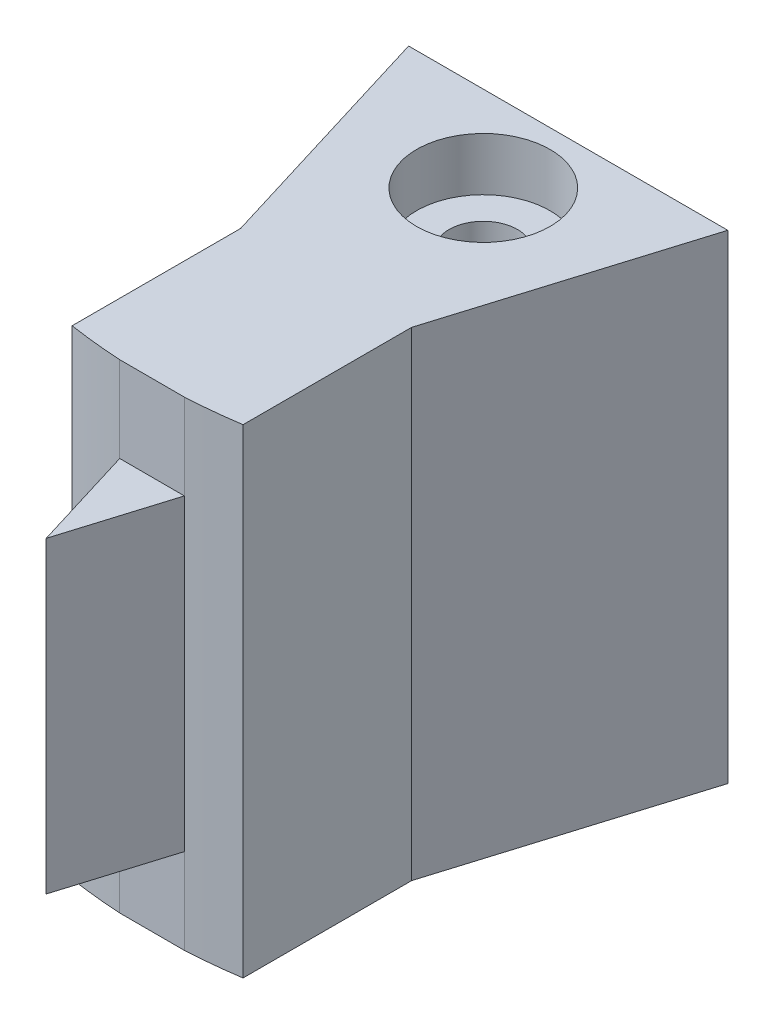
ISO-10303-21;
HEADER;
FILE_DESCRIPTION(('STEP AP214'),'2;1');
FILE_NAME('part.step','',(''),(''),'','','');
FILE_SCHEMA(('AUTOMOTIVE_DESIGN { 1 0 10303 214 1 1 1 1 }'));
ENDSEC;
DATA;
#1=APPLICATION_CONTEXT('core data for automotive mechanical design processes');
#2=APPLICATION_PROTOCOL_DEFINITION('international standard','automotive_design',2000,#1);
#3=PRODUCT_CONTEXT('',#1,'mechanical');
#4=PRODUCT('Part','Part','',(#3));
#5=PRODUCT_RELATED_PRODUCT_CATEGORY('part','',(#4));
#6=PRODUCT_DEFINITION_FORMATION('','',#4);
#7=PRODUCT_DEFINITION_CONTEXT('part definition',#1,'design');
#8=PRODUCT_DEFINITION('design','',#6,#7);
#9=PRODUCT_DEFINITION_SHAPE('','',#8);
#10=(LENGTH_UNIT() NAMED_UNIT(*) SI_UNIT(.MILLI.,.METRE.));
#11=(NAMED_UNIT(*) PLANE_ANGLE_UNIT() SI_UNIT($,.RADIAN.));
#12=(NAMED_UNIT(*) SI_UNIT($,.STERADIAN.) SOLID_ANGLE_UNIT());
#13=UNCERTAINTY_MEASURE_WITH_UNIT(LENGTH_MEASURE(1.E-05),#10,'distance_accuracy_value','');
#14=(GEOMETRIC_REPRESENTATION_CONTEXT(3) GLOBAL_UNCERTAINTY_ASSIGNED_CONTEXT((#13)) GLOBAL_UNIT_ASSIGNED_CONTEXT((#10,
#11,#12)) REPRESENTATION_CONTEXT('',''));
#15=CARTESIAN_POINT('',(0.,0.,0.));
#16=DIRECTION('',(0.,0.,1.));
#17=DIRECTION('',(1.,0.,0.));
#18=AXIS2_PLACEMENT_3D('',#15,#16,#17);
#19=CARTESIAN_POINT('',(0.,-2.,0.));
#20=DIRECTION('',(0.,1.,0.));
#21=DIRECTION('',(0.,0.,1.));
#22=AXIS2_PLACEMENT_3D('',#19,#20,#21);
#23=PLANE('',#22);
#24=CARTESIAN_POINT('',(0.,-2.,7.06537000902889));
#25=DIRECTION('',(0.,1.,0.));
#26=DIRECTION('',(0.,0.,1.));
#27=AXIS2_PLACEMENT_3D('',#24,#25,#26);
#28=CIRCLE('',#27,0.999999999999795);
#29=CARTESIAN_POINT('',(0.,-2.,8.06537000902868));
#30=VERTEX_POINT('',#29);
#31=EDGE_CURVE('E189',#30,#30,#28,.T.);
#32=ORIENTED_EDGE('',*,*,#31,.T.);
#33=EDGE_LOOP('',(#32));
#34=FACE_BOUND('',#33,.T.);
#35=DIRECTION('',(-0.999999257321064,0.,-0.00121875236263439));
#36=VECTOR('',#35,1.);
#37=CARTESIAN_POINT('',(-0.965732534292428,-2.,16.7221140691389));
#38=LINE('',#37,#36);
#39=CARTESIAN_POINT('',(0.9249694635884,-2.,16.7244183683773));
#40=VERTEX_POINT('',#39);
#41=CARTESIAN_POINT('',(-0.965732534292428,-2.,16.7221140691389));
#42=VERTEX_POINT('',#41);
#43=EDGE_CURVE('E148',#40,#42,#38,.T.);
#44=ORIENTED_EDGE('',*,*,#43,.T.);
#45=CARTESIAN_POINT('',(0.,-2.,0.));
#46=DIRECTION('',(0.,1.,0.));
#47=DIRECTION('',(0.,0.,1.));
#48=AXIS2_PLACEMENT_3D('',#45,#46,#47);
#49=CIRCLE('',#48,16.7499772617483);
#50=CARTESIAN_POINT('',(-2.52002928786345,-2.,16.559323375591));
#51=VERTEX_POINT('',#50);
#52=EDGE_CURVE('E315',#51,#42,#49,.T.);
#53=ORIENTED_EDGE('',*,*,#52,.F.);
#54=DIRECTION('',(0.,0.,1.));
#55=VECTOR('',#54,1.);
#56=CARTESIAN_POINT('',(-2.52002928786344,-2.,16.559323375591));
#57=LINE('',#56,#55);
#58=CARTESIAN_POINT('',(-2.52002928786344,-2.,11.6382384628191));
#59=VERTEX_POINT('',#58);
#60=EDGE_CURVE('E282',#59,#51,#57,.T.);
#61=ORIENTED_EDGE('',*,*,#60,.F.);
#62=DIRECTION('',(0.292371704722738,0.,0.956304755963035));
#63=VECTOR('',#62,1.);
#64=CARTESIAN_POINT('',(-2.52002928786344,-2.,11.6382384628191));
#65=LINE('',#64,#63);
#66=CARTESIAN_POINT('',(-4.68242218010818,-2.,4.56537000902889));
#67=VERTEX_POINT('',#66);
#68=EDGE_CURVE('E311',#67,#59,#65,.T.);
#69=ORIENTED_EDGE('',*,*,#68,.F.);
#70=DIRECTION('',(-1.,0.,0.));
#71=VECTOR('',#70,1.);
#72=CARTESIAN_POINT('',(4.6423636043806,-2.,4.56537000902889));
#73=LINE('',#72,#71);
#74=CARTESIAN_POINT('',(4.6423636043806,-2.,4.56537000902889));
#75=VERTEX_POINT('',#74);
#76=EDGE_CURVE('E185',#75,#67,#73,.T.);
#77=ORIENTED_EDGE('',*,*,#76,.F.);
#78=DIRECTION('',(0.292371704722744,0.,-0.956304755963033));
#79=VECTOR('',#78,1.);
#80=CARTESIAN_POINT('',(2.47997071213585,-2.,11.6382384628189));
#81=LINE('',#80,#79);
#82=CARTESIAN_POINT('',(2.47997071213585,-2.,11.6382384628189));
#83=VERTEX_POINT('',#82);
#84=EDGE_CURVE('E322',#83,#75,#81,.T.);
#85=ORIENTED_EDGE('',*,*,#84,.F.);
#86=DIRECTION('',(0.,0.,-1.));
#87=VECTOR('',#86,1.);
#88=CARTESIAN_POINT('',(2.47997071213586,-2.,16.5653700090289));
#89=LINE('',#88,#87);
#90=CARTESIAN_POINT('',(2.47997071213586,-2.,16.5653700090289));
#91=VERTEX_POINT('',#90);
#92=EDGE_CURVE('E319',#91,#83,#89,.T.);
#93=ORIENTED_EDGE('',*,*,#92,.F.);
#94=CARTESIAN_POINT('',(0.,-2.,0.));
#95=DIRECTION('',(0.,1.,0.));
#96=DIRECTION('',(0.,0.,1.));
#97=AXIS2_PLACEMENT_3D('',#94,#95,#96);
#98=CIRCLE('',#97,16.7499772617483);
#99=EDGE_CURVE('E317',#40,#91,#98,.T.);
#100=ORIENTED_EDGE('',*,*,#99,.F.);
#101=EDGE_LOOP('',(#44,#53,#61,#69,#77,#85,#93,#100));
#102=FACE_BOUND('',#101,.T.);
#103=ADVANCED_FACE('F34',(#34,#102),#23,.F.);
#104=CARTESIAN_POINT('',(0.,-2.,7.06537000902889));
#105=DIRECTION('',(0.,1.,0.));
#106=DIRECTION('',(0.,0.,1.));
#107=AXIS2_PLACEMENT_3D('',#104,#105,#106);
#108=CYLINDRICAL_SURFACE('',#107,0.999999999999795);
#109=CARTESIAN_POINT('',(0.,8.04993423332817,8.06537000902868));
#110=CARTESIAN_POINT('',(0.0546821791008583,8.04957510796057,8.06537003134291));
#111=CARTESIAN_POINT('',(0.109354914126313,8.04773172784484,8.0608700796451));
#112=CARTESIAN_POINT('',(0.217072928600973,8.04124911512665,8.0430513451388));
#113=CARTESIAN_POINT('',(0.270117951898951,8.03660944482233,8.02973118167488));
#114=CARTESIAN_POINT('',(0.373013096085539,8.02501178523372,7.9947834956713));
#115=CARTESIAN_POINT('',(0.422868473539474,8.01805773387999,7.97317007466059));
#116=CARTESIAN_POINT('',(0.518239677542274,8.0025163131362,7.92231226129294));
#117=CARTESIAN_POINT('',(0.563754694999942,7.99392864011102,7.89306644995588));
#118=CARTESIAN_POINT('',(0.650728756928361,7.97567153728027,7.82670873711479));
#119=CARTESIAN_POINT('',(0.692016888170348,7.96597671144099,7.789379829442));
#120=CARTESIAN_POINT('',(0.767869116779314,7.94673554743403,7.7083762283634));
#121=CARTESIAN_POINT('',(0.802431776578923,7.93718924141274,7.66470018173609));
#122=CARTESIAN_POINT('',(0.864765151781451,7.9190279300453,7.57078261325581));
#123=CARTESIAN_POINT('',(0.892326299349003,7.91044519441127,7.52039518357942));
#124=CARTESIAN_POINT('',(0.93850585682681,7.89556616206643,7.41536260915564));
#125=CARTESIAN_POINT('',(0.957127077871138,7.88926914676958,7.36071880910147));
#126=CARTESIAN_POINT('',(0.984242433141645,7.87995461814353,7.25073786122399));
#127=CARTESIAN_POINT('',(0.993067689027359,7.87683020189832,7.19549165552767));
#128=CARTESIAN_POINT('',(1.00137637507627,7.87389140563371,7.08422109971251));
#129=CARTESIAN_POINT('',(1.00086267310011,7.87407600946125,7.0281969937563));
#130=CARTESIAN_POINT('',(0.990760960883652,7.87764266918269,6.9196726621084));
#131=CARTESIAN_POINT('',(0.9815876579736,7.88087859001701,6.86712821582432));
#132=CARTESIAN_POINT('',(0.955100149434767,7.88995096415066,6.7643720433402));
#133=CARTESIAN_POINT('',(0.937784973426305,7.89578772742404,6.71416059597993));
#134=CARTESIAN_POINT('',(0.895224866547383,7.9095214589458,6.6165321043677));
#135=CARTESIAN_POINT('',(0.869854126003333,7.91745075100132,6.56917464604347));
#136=CARTESIAN_POINT('',(0.811993742784765,7.93447527343158,6.47925869308694));
#137=CARTESIAN_POINT('',(0.779502046774439,7.94357083978834,6.43670158801433));
#138=CARTESIAN_POINT('',(0.706310455681535,7.96250407370063,6.35524458013623));
#139=CARTESIAN_POINT('',(0.665269123333407,7.97235562915793,6.31665408360598));
#140=CARTESIAN_POINT('',(0.57718349640282,7.99129803558881,6.24682351617368));
#141=CARTESIAN_POINT('',(0.530138584475256,8.00038880817205,6.21558420213093));
#142=CARTESIAN_POINT('',(0.430676287465458,8.01694054662281,6.16106484602444));
#143=CARTESIAN_POINT('',(0.378205748438876,8.02438259034933,6.13787563631923));
#144=CARTESIAN_POINT('',(0.269803272333862,8.03668686866798,6.10075330920549));
#145=CARTESIAN_POINT('',(0.213872509814025,8.04154997336309,6.08681706955583));
#146=CARTESIAN_POINT('',(0.102675980012127,8.04801791966966,6.06913107849329));
#147=CARTESIAN_POINT('',(0.0474822649655288,8.04975195790463,6.06497514173016));
#148=CARTESIAN_POINT('',(-0.062841562578232,8.05019803748353,6.0658238541015));
#149=CARTESIAN_POINT('',(-0.117971684440283,8.04891060250061,6.07082691579136));
#150=CARTESIAN_POINT('',(-0.224905098860214,8.04356865345427,6.0895227717292));
#151=CARTESIAN_POINT('',(-0.276758555693752,8.03959688095112,6.10295488916952));
#152=CARTESIAN_POINT('',(-0.377465816854323,8.02940636298477,6.1378141051382));
#153=CARTESIAN_POINT('',(-0.426319262034683,8.023187349104,6.15924215873627));
#154=CARTESIAN_POINT('',(-0.520961047176233,8.00897230857024,6.2100604659352));
#155=CARTESIAN_POINT('',(-0.56664648946787,8.00093688998407,6.23963099794259));
#156=CARTESIAN_POINT('',(-0.652542615445182,7.98401517307955,6.30568228657444));
#157=CARTESIAN_POINT('',(-0.692751707956584,7.97512862873537,6.34216504424128));
#158=CARTESIAN_POINT('',(-0.768368832186381,7.95703672574766,6.42287653863801));
#159=CARTESIAN_POINT('',(-0.803492685593691,7.94783427305354,6.46737277538543));
#160=CARTESIAN_POINT('',(-0.865812896971173,7.93056297373202,6.56181430612799));
#161=CARTESIAN_POINT('',(-0.893009191170613,7.92249413622389,6.61175964395225));
#162=CARTESIAN_POINT('',(-0.93860002809944,7.90848745209485,6.71573217026841));
#163=CARTESIAN_POINT('',(-0.957006080265415,7.90254682148456,6.76975391336835));
#164=CARTESIAN_POINT('',(-0.984385447206508,7.89356679235735,6.88036261430816));
#165=CARTESIAN_POINT('',(-0.993362642639482,7.89052620031178,6.93694850680402));
#166=CARTESIAN_POINT('',(-1.00133163032267,7.88782991758709,7.04818230585044));
#167=CARTESIAN_POINT('',(-1.00077845522218,7.88801997192804,7.10279422493157));
#168=CARTESIAN_POINT('',(-0.990816979227546,7.89138344959079,7.2111059021235));
#169=CARTESIAN_POINT('',(-0.981409159874997,7.89455671067702,7.26480570967593));
#170=CARTESIAN_POINT('',(-0.954326006544328,7.9034093497575,7.36885594585061));
#171=CARTESIAN_POINT('',(-0.93679515967912,7.90904483516274,7.41924801009585));
#172=CARTESIAN_POINT('',(-0.894078597598819,7.92216267155419,7.51641516301268));
#173=CARTESIAN_POINT('',(-0.868891247980462,7.92964541680349,7.56318947674053));
#174=CARTESIAN_POINT('',(-0.810369867509393,7.94598359665671,7.65386853886868));
#175=CARTESIAN_POINT('',(-0.77674447780868,7.95488269367924,7.69757735474064));
#176=CARTESIAN_POINT('',(-0.702796321419853,7.97283954400179,7.77888143930106));
#177=CARTESIAN_POINT('',(-0.662471761379367,7.98189733920258,7.81647506561976));
#178=CARTESIAN_POINT('',(-0.574566833244137,7.99951060425278,7.88580532807813));
#179=CARTESIAN_POINT('',(-0.526781666832342,8.00803733466449,7.91729045245041));
#180=CARTESIAN_POINT('',(-0.42631739774144,8.02324420992143,7.97174481231141));
#181=CARTESIAN_POINT('',(-0.373639825535718,8.02992492966511,7.99471669981804));
#182=CARTESIAN_POINT('',(-0.268082191246858,8.04033135878697,8.03027889077587));
#183=CARTESIAN_POINT('',(-0.215395649662794,8.0442075496373,8.0433995880839));
#184=CARTESIAN_POINT('',(-0.108469393021752,8.04918673358584,8.06094409709436));
#185=CARTESIAN_POINT('',(-0.0542300522364938,8.05029038935129,8.06536998689896));
#186=CARTESIAN_POINT('',(0.,8.04993423332817,8.06537000902868));
#187=B_SPLINE_CURVE_WITH_KNOTS('',3,(#109,#110,#111,#112,#113,#114,#115,#116,#117,#118,#119,
#120,#121,#122,#123,#124,#125,#126,#127,#128,#129,#130,#131,#132,#133,#134,#135,#136,#137,#138,
#139,#140,#141,#142,#143,#144,#145,#146,#147,#148,#149,#150,#151,#152,#153,#154,#155,#156,#157,
#158,#159,#160,#161,#162,#163,#164,#165,#166,#167,#168,#169,#170,#171,#172,#173,#174,#175,#176,
#177,#178,#179,#180,#181,#182,#183,#184,#185,#186),.UNSPECIFIED.,.T.,.F.,(4,2,2,2,2,2,2,2,2,2,2,
2,2,2,2,2,2,2,2,2,2,2,2,2,2,2,2,2,2,2,2,2,2,2,2,2,2,2,4),(0.,0.163850025249574,
0.327725704522644,0.491323962064701,0.654952656763244,0.823688007705298,0.992459386251046,
1.16580686426491,1.33909979790539,1.50633759959776,1.67352404581622,1.83308952664911,
1.99267402993054,2.15488479838886,2.31714240219587,2.48792062945065,2.65871643191757,
2.83138111770077,3.00398751137512,3.16928819199397,3.33456022528499,3.49495717905623,
3.65537329747939,3.81967478229686,3.98402390415544,4.15550728499601,4.3269920452421,
4.49825165341347,4.66944074819148,4.8324799741171,4.99551033400223,5.1557460102489,
5.31601591541802,5.48284858292627,5.64972598333096,5.82245323043527,5.99512662474741,
6.15766074540813,6.32015601487876),.UNSPECIFIED.);
#188=CARTESIAN_POINT('',(0.,8.04993423332817,8.06537000902868));
#189=VERTEX_POINT('',#188);
#190=EDGE_CURVE('E188',#189,#189,#187,.T.);
#191=ORIENTED_EDGE('',*,*,#190,.F.);
#192=EDGE_LOOP('',(#191));
#193=FACE_BOUND('',#192,.T.);
#194=CARTESIAN_POINT('',(0.,10.45,7.06537000902889));
#195=DIRECTION('',(0.,1.,0.));
#196=DIRECTION('',(0.,0.,1.));
#197=AXIS2_PLACEMENT_3D('',#194,#195,#196);
#198=CIRCLE('',#197,0.999999999999795);
#199=CARTESIAN_POINT('',(0.,10.45,8.06537000902868));
#200=VERTEX_POINT('',#199);
#201=EDGE_CURVE('E38',#200,#200,#198,.F.);
#202=ORIENTED_EDGE('',*,*,#201,.F.);
#203=EDGE_LOOP('',(#202));
#204=FACE_BOUND('',#203,.T.);
#205=ADVANCED_FACE('F222',(#193,#204),#108,.F.);
#206=CARTESIAN_POINT('',(-2.52002928786344,-2.,11.6382384628191));
#207=DIRECTION('',(-0.956304755963035,0.,0.292371704722738));
#208=DIRECTION('',(0.292371704722738,0.,0.956304755963035));
#209=AXIS2_PLACEMENT_3D('',#206,#207,#208);
#210=PLANE('',#209);
#211=DIRECTION('',(0.,1.,0.));
#212=VECTOR('',#211,1.);
#213=CARTESIAN_POINT('',(-2.52002928786344,-2.,11.6382384628191));
#214=LINE('',#213,#212);
#215=CARTESIAN_POINT('',(-2.52002928786344,12.,11.6382384628191));
#216=VERTEX_POINT('',#215);
#217=EDGE_CURVE('E184',#59,#216,#214,.T.);
#218=ORIENTED_EDGE('',*,*,#217,.T.);
#219=DIRECTION('',(0.292371704722738,0.,0.956304755963035));
#220=VECTOR('',#219,1.);
#221=CARTESIAN_POINT('',(-2.52002928786344,12.,11.6382384628191));
#222=LINE('',#221,#220);
#223=CARTESIAN_POINT('',(-4.68242218010818,12.,4.56537000902889));
#224=VERTEX_POINT('',#223);
#225=EDGE_CURVE('E292',#224,#216,#222,.T.);
#226=ORIENTED_EDGE('',*,*,#225,.F.);
#227=DIRECTION('',(0.,1.,0.));
#228=VECTOR('',#227,1.);
#229=CARTESIAN_POINT('',(-4.68242218010818,-2.,4.56537000902889));
#230=LINE('',#229,#228);
#231=EDGE_CURVE('E11',#67,#224,#230,.T.);
#232=ORIENTED_EDGE('',*,*,#231,.F.);
#233=ORIENTED_EDGE('',*,*,#68,.T.);
#234=EDGE_LOOP('',(#218,#226,#232,#233));
#235=FACE_BOUND('',#234,.T.);
#236=ADVANCED_FACE('F36',(#235),#210,.T.);
#237=CARTESIAN_POINT('',(4.6423636043806,-2.,4.56537000902889));
#238=DIRECTION('',(0.,0.,-1.));
#239=DIRECTION('',(-1.,0.,0.));
#240=AXIS2_PLACEMENT_3D('',#237,#238,#239);
#241=PLANE('',#240);
#242=CARTESIAN_POINT('',(-0.0200292878636934,5.,4.56537000902889));
#243=DIRECTION('',(0.,0.,-1.));
#244=DIRECTION('',(-1.,0.,0.));
#245=AXIS2_PLACEMENT_3D('',#242,#243,#244);
#246=CIRCLE('',#245,3.04999999999991);
#247=CARTESIAN_POINT('',(-2.91830463710158,5.95,4.56537000902889));
#248=VERTEX_POINT('',#247);
#249=CARTESIAN_POINT('',(2.87824606137399,5.95,4.56537000902889));
#250=VERTEX_POINT('',#249);
#251=EDGE_CURVE('E51',#248,#250,#246,.T.);
#252=ORIENTED_EDGE('',*,*,#251,.F.);
#253=DIRECTION('',(-1.,0.,0.));
#254=VECTOR('',#253,1.);
#255=CARTESIAN_POINT('',(2.87824606137399,5.95,4.56537000902889));
#256=LINE('',#255,#254);
#257=EDGE_CURVE('E534',#250,#248,#256,.T.);
#258=ORIENTED_EDGE('',*,*,#257,.F.);
#259=EDGE_LOOP('',(#252,#258));
#260=FACE_BOUND('',#259,.T.);
#261=CARTESIAN_POINT('',(-0.0200292878636934,5.,4.56537000902889));
#262=DIRECTION('',(0.,0.,-1.));
#263=DIRECTION('',(-1.,0.,0.));
#264=AXIS2_PLACEMENT_3D('',#261,#262,#263);
#265=CIRCLE('',#264,3.04999999999991);
#266=CARTESIAN_POINT('',(2.878246061374,4.05,4.56537000902889));
#267=VERTEX_POINT('',#266);
#268=CARTESIAN_POINT('',(-2.91830463710158,4.05,4.56537000902889));
#269=VERTEX_POINT('',#268);
#270=EDGE_CURVE('E59',#267,#269,#265,.T.);
#271=ORIENTED_EDGE('',*,*,#270,.F.);
#272=DIRECTION('',(1.,0.,0.));
#273=VECTOR('',#272,1.);
#274=CARTESIAN_POINT('',(2.878246061374,4.05,4.56537000902889));
#275=LINE('',#274,#273);
#276=EDGE_CURVE('E520',#269,#267,#275,.T.);
#277=ORIENTED_EDGE('',*,*,#276,.F.);
#278=EDGE_LOOP('',(#271,#277));
#279=FACE_BOUND('',#278,.T.);
#280=ORIENTED_EDGE('',*,*,#231,.T.);
#281=DIRECTION('',(-1.,0.,0.));
#282=VECTOR('',#281,1.);
#283=CARTESIAN_POINT('',(4.6423636043806,12.,4.56537000902889));
#284=LINE('',#283,#282);
#285=CARTESIAN_POINT('',(4.6423636043806,12.,4.56537000902889));
#286=VERTEX_POINT('',#285);
#287=EDGE_CURVE('E309',#286,#224,#284,.T.);
#288=ORIENTED_EDGE('',*,*,#287,.F.);
#289=DIRECTION('',(0.,1.,0.));
#290=VECTOR('',#289,1.);
#291=CARTESIAN_POINT('',(4.6423636043806,-2.,4.56537000902889));
#292=LINE('',#291,#290);
#293=EDGE_CURVE('E43',#75,#286,#292,.T.);
#294=ORIENTED_EDGE('',*,*,#293,.F.);
#295=ORIENTED_EDGE('',*,*,#76,.T.);
#296=EDGE_LOOP('',(#280,#288,#294,#295));
#297=FACE_BOUND('',#296,.T.);
#298=ADVANCED_FACE('F249',(#260,#279,#297),#241,.T.);
#299=CARTESIAN_POINT('',(2.47997071213585,-2.,11.6382384628189));
#300=DIRECTION('',(0.956304755963033,0.,0.292371704722744));
#301=DIRECTION('',(0.292371704722744,0.,-0.956304755963033));
#302=AXIS2_PLACEMENT_3D('',#299,#300,#301);
#303=PLANE('',#302);
#304=ORIENTED_EDGE('',*,*,#293,.T.);
#305=DIRECTION('',(0.292371704722744,0.,-0.956304755963033));
#306=VECTOR('',#305,1.);
#307=CARTESIAN_POINT('',(2.47997071213585,12.,11.6382384628189));
#308=LINE('',#307,#306);
#309=CARTESIAN_POINT('',(2.47997071213585,12.,11.6382384628189));
#310=VERTEX_POINT('',#309);
#311=EDGE_CURVE('E306',#310,#286,#308,.T.);
#312=ORIENTED_EDGE('',*,*,#311,.F.);
#313=DIRECTION('',(0.,1.,0.));
#314=VECTOR('',#313,1.);
#315=CARTESIAN_POINT('',(2.47997071213585,-2.,11.6382384628189));
#316=LINE('',#315,#314);
#317=EDGE_CURVE('E327',#83,#310,#316,.T.);
#318=ORIENTED_EDGE('',*,*,#317,.F.);
#319=ORIENTED_EDGE('',*,*,#84,.T.);
#320=EDGE_LOOP('',(#304,#312,#318,#319));
#321=FACE_BOUND('',#320,.T.);
#322=ADVANCED_FACE('F252',(#321),#303,.T.);
#323=CARTESIAN_POINT('',(2.47997071213586,-2.,16.5653700090289));
#324=DIRECTION('',(1.,0.,0.));
#325=DIRECTION('',(0.,0.,-1.));
#326=AXIS2_PLACEMENT_3D('',#323,#324,#325);
#327=PLANE('',#326);
#328=ORIENTED_EDGE('',*,*,#317,.T.);
#329=DIRECTION('',(0.,0.,-1.));
#330=VECTOR('',#329,1.);
#331=CARTESIAN_POINT('',(2.47997071213586,12.,16.5653700090289));
#332=LINE('',#331,#330);
#333=CARTESIAN_POINT('',(2.47997071213586,12.,16.5653700090289));
#334=VERTEX_POINT('',#333);
#335=EDGE_CURVE('E300',#334,#310,#332,.T.);
#336=ORIENTED_EDGE('',*,*,#335,.F.);
#337=DIRECTION('',(0.,1.,0.));
#338=VECTOR('',#337,1.);
#339=CARTESIAN_POINT('',(2.47997071213586,-2.,16.5653700090289));
#340=LINE('',#339,#338);
#341=EDGE_CURVE('E153',#91,#334,#340,.T.);
#342=ORIENTED_EDGE('',*,*,#341,.F.);
#343=ORIENTED_EDGE('',*,*,#92,.T.);
#344=EDGE_LOOP('',(#328,#336,#342,#343));
#345=FACE_BOUND('',#344,.T.);
#346=ADVANCED_FACE('F256',(#345),#327,.T.);
#347=CARTESIAN_POINT('',(0.,-2.,0.));
#348=DIRECTION('',(0.,1.,0.));
#349=DIRECTION('',(0.,0.,1.));
#350=AXIS2_PLACEMENT_3D('',#347,#348,#349);
#351=CYLINDRICAL_SURFACE('',#350,16.7499772617483);
#352=ORIENTED_EDGE('',*,*,#341,.T.);
#353=CARTESIAN_POINT('',(0.,12.,0.));
#354=DIRECTION('',(0.,1.,0.));
#355=DIRECTION('',(0.,0.,1.));
#356=AXIS2_PLACEMENT_3D('',#353,#354,#355);
#357=CIRCLE('',#356,16.7499772617483);
#358=CARTESIAN_POINT('',(0.9249694635884,12.,16.7244183683773));
#359=VERTEX_POINT('',#358);
#360=EDGE_CURVE('E297',#359,#334,#357,.T.);
#361=ORIENTED_EDGE('',*,*,#360,.F.);
#362=DIRECTION('',(0.,1.,0.));
#363=VECTOR('',#362,1.);
#364=CARTESIAN_POINT('',(0.9249694635884,9.5,16.7244183683773));
#365=LINE('',#364,#363);
#366=CARTESIAN_POINT('',(0.9249694635884,9.5,16.7244183683773));
#367=VERTEX_POINT('',#366);
#368=EDGE_CURVE('E173',#367,#359,#365,.T.);
#369=ORIENTED_EDGE('',*,*,#368,.F.);
#370=DIRECTION('',(0.,1.,0.));
#371=VECTOR('',#370,1.);
#372=CARTESIAN_POINT('',(0.9249694635884,-2.,16.7244183683773));
#373=LINE('',#372,#371);
#374=CARTESIAN_POINT('',(0.9249694635884,0.5,16.7244183683773));
#375=VERTEX_POINT('',#374);
#376=EDGE_CURVE('E154',#375,#367,#373,.T.);
#377=ORIENTED_EDGE('',*,*,#376,.F.);
#378=EDGE_CURVE('E142',#40,#375,#373,.T.);
#379=ORIENTED_EDGE('',*,*,#378,.F.);
#380=ORIENTED_EDGE('',*,*,#99,.T.);
#381=EDGE_LOOP('',(#352,#361,#369,#377,#379,#380));
#382=FACE_BOUND('',#381,.T.);
#383=ADVANCED_FACE('F171',(#382),#351,.T.);
#384=CARTESIAN_POINT('',(0.924969463588401,-2.,16.7244183683773));
#385=DIRECTION('',(0.956304755963035,0.,0.292371704722738));
#386=DIRECTION('',(0.292371704722738,0.,-0.956304755963035));
#387=AXIS2_PLACEMENT_3D('',#384,#385,#386);
#388=PLANE('',#387);
#389=DIRECTION('',(0.292371704722737,0.,-0.956304755963035));
#390=VECTOR('',#389,1.);
#391=CARTESIAN_POINT('',(0.9249694635884,0.5,16.7244183683773));
#392=LINE('',#391,#390);
#393=CARTESIAN_POINT('',(-0.0200292878637907,0.5,19.8153700090289));
#394=VERTEX_POINT('',#393);
#395=EDGE_CURVE('E159',#394,#375,#392,.T.);
#396=ORIENTED_EDGE('',*,*,#395,.T.);
#397=ORIENTED_EDGE('',*,*,#376,.T.);
#398=DIRECTION('',(0.292371704722737,0.,-0.956304755963035));
#399=VECTOR('',#398,1.);
#400=CARTESIAN_POINT('',(0.9249694635884,9.5,16.7244183683773));
#401=LINE('',#400,#399);
#402=CARTESIAN_POINT('',(-0.0200292878637907,9.5,19.8153700090289));
#403=VERTEX_POINT('',#402);
#404=EDGE_CURVE('E341',#403,#367,#401,.T.);
#405=ORIENTED_EDGE('',*,*,#404,.F.);
#406=DIRECTION('',(0.,1.,0.));
#407=VECTOR('',#406,1.);
#408=CARTESIAN_POINT('',(-0.0200292878637907,-2.,19.8153700090289));
#409=LINE('',#408,#407);
#410=EDGE_CURVE('E168',#394,#403,#409,.T.);
#411=ORIENTED_EDGE('',*,*,#410,.F.);
#412=EDGE_LOOP('',(#396,#397,#405,#411));
#413=FACE_BOUND('',#412,.T.);
#414=ADVANCED_FACE('F165',(#413),#388,.T.);
#415=CARTESIAN_POINT('',(-0.0200292878637907,-2.,19.8153700090289));
#416=DIRECTION('',(-0.956304755963032,0.,0.292371704722747));
#417=DIRECTION('',(0.292371704722747,0.,0.956304755963033));
#418=AXIS2_PLACEMENT_3D('',#415,#416,#417);
#419=PLANE('',#418);
#420=DIRECTION('',(0.292371704722747,0.,0.956304755963033));
#421=VECTOR('',#420,1.);
#422=CARTESIAN_POINT('',(-0.0200292878637907,0.5,19.8153700090289));
#423=LINE('',#422,#421);
#424=CARTESIAN_POINT('',(-0.965732534292428,0.5,16.7221140691389));
#425=VERTEX_POINT('',#424);
#426=EDGE_CURVE('E161',#425,#394,#423,.T.);
#427=ORIENTED_EDGE('',*,*,#426,.T.);
#428=ORIENTED_EDGE('',*,*,#410,.T.);
#429=DIRECTION('',(0.292371704722747,0.,0.956304755963033));
#430=VECTOR('',#429,1.);
#431=CARTESIAN_POINT('',(-0.0200292878637907,9.5,19.8153700090289));
#432=LINE('',#431,#430);
#433=CARTESIAN_POINT('',(-0.965732534292428,9.5,16.7221140691389));
#434=VERTEX_POINT('',#433);
#435=EDGE_CURVE('E336',#434,#403,#432,.T.);
#436=ORIENTED_EDGE('',*,*,#435,.F.);
#437=DIRECTION('',(0.,1.,0.));
#438=VECTOR('',#437,1.);
#439=CARTESIAN_POINT('',(-0.965732534292428,-2.,16.7221140691389));
#440=LINE('',#439,#438);
#441=EDGE_CURVE('E181',#425,#434,#440,.T.);
#442=ORIENTED_EDGE('',*,*,#441,.F.);
#443=EDGE_LOOP('',(#427,#428,#436,#442));
#444=FACE_BOUND('',#443,.T.);
#445=ADVANCED_FACE('F265',(#444),#419,.T.);
#446=CARTESIAN_POINT('',(0.,-2.,0.));
#447=DIRECTION('',(0.,1.,0.));
#448=DIRECTION('',(0.,0.,1.));
#449=AXIS2_PLACEMENT_3D('',#446,#447,#448);
#450=CYLINDRICAL_SURFACE('',#449,16.7499772617483);
#451=EDGE_CURVE('E174',#42,#425,#440,.T.);
#452=ORIENTED_EDGE('',*,*,#451,.T.);
#453=ORIENTED_EDGE('',*,*,#441,.T.);
#454=DIRECTION('',(0.,1.,0.));
#455=VECTOR('',#454,1.);
#456=CARTESIAN_POINT('',(-0.965732534292428,9.5,16.7221140691389));
#457=LINE('',#456,#455);
#458=CARTESIAN_POINT('',(-0.965732534292428,12.,16.7221140691389));
#459=VERTEX_POINT('',#458);
#460=EDGE_CURVE('E296',#434,#459,#457,.T.);
#461=ORIENTED_EDGE('',*,*,#460,.T.);
#462=CARTESIAN_POINT('',(0.,12.,0.));
#463=DIRECTION('',(0.,1.,0.));
#464=DIRECTION('',(0.,0.,1.));
#465=AXIS2_PLACEMENT_3D('',#462,#463,#464);
#466=CIRCLE('',#465,16.7499772617483);
#467=CARTESIAN_POINT('',(-2.52002928786345,12.,16.559323375591));
#468=VERTEX_POINT('',#467);
#469=EDGE_CURVE('E289',#468,#459,#466,.T.);
#470=ORIENTED_EDGE('',*,*,#469,.F.);
#471=DIRECTION('',(0.,1.,0.));
#472=VECTOR('',#471,1.);
#473=CARTESIAN_POINT('',(-2.52002928786345,-2.,16.559323375591));
#474=LINE('',#473,#472);
#475=EDGE_CURVE('E182',#51,#468,#474,.T.);
#476=ORIENTED_EDGE('',*,*,#475,.F.);
#477=ORIENTED_EDGE('',*,*,#52,.T.);
#478=EDGE_LOOP('',(#452,#453,#461,#470,#476,#477));
#479=FACE_BOUND('',#478,.T.);
#480=ADVANCED_FACE('F268',(#479),#450,.T.);
#481=CARTESIAN_POINT('',(-2.52002928786344,-2.,16.559323375591));
#482=DIRECTION('',(-1.,0.,0.));
#483=DIRECTION('',(0.,0.,1.));
#484=AXIS2_PLACEMENT_3D('',#481,#482,#483);
#485=PLANE('',#484);
#486=ORIENTED_EDGE('',*,*,#475,.T.);
#487=DIRECTION('',(0.,0.,1.));
#488=VECTOR('',#487,1.);
#489=CARTESIAN_POINT('',(-2.52002928786344,12.,16.559323375591));
#490=LINE('',#489,#488);
#491=EDGE_CURVE('E279',#216,#468,#490,.T.);
#492=ORIENTED_EDGE('',*,*,#491,.F.);
#493=ORIENTED_EDGE('',*,*,#217,.F.);
#494=ORIENTED_EDGE('',*,*,#60,.T.);
#495=EDGE_LOOP('',(#486,#492,#493,#494));
#496=FACE_BOUND('',#495,.T.);
#497=ADVANCED_FACE('F245',(#496),#485,.T.);
#498=CARTESIAN_POINT('',(0.,12.,0.));
#499=DIRECTION('',(0.,1.,0.));
#500=DIRECTION('',(0.,0.,1.));
#501=AXIS2_PLACEMENT_3D('',#498,#499,#500);
#502=PLANE('',#501);
#503=DIRECTION('',(-0.999999257321064,0.,-0.00121875236263439));
#504=VECTOR('',#503,1.);
#505=CARTESIAN_POINT('',(-0.965732534292428,12.,16.7221140691389));
#506=LINE('',#505,#504);
#507=EDGE_CURVE('E331',#359,#459,#506,.T.);
#508=ORIENTED_EDGE('',*,*,#507,.F.);
#509=ORIENTED_EDGE('',*,*,#360,.T.);
#510=ORIENTED_EDGE('',*,*,#335,.T.);
#511=ORIENTED_EDGE('',*,*,#311,.T.);
#512=ORIENTED_EDGE('',*,*,#287,.T.);
#513=ORIENTED_EDGE('',*,*,#225,.T.);
#514=ORIENTED_EDGE('',*,*,#491,.T.);
#515=ORIENTED_EDGE('',*,*,#469,.T.);
#516=EDGE_LOOP('',(#508,#509,#510,#511,#512,#513,#514,#515));
#517=FACE_BOUND('',#516,.T.);
#518=CARTESIAN_POINT('',(0.,12.,7.06537000902889));
#519=DIRECTION('',(0.,1.,0.));
#520=DIRECTION('',(0.,0.,1.));
#521=AXIS2_PLACEMENT_3D('',#518,#519,#520);
#522=CIRCLE('',#521,1.95);
#523=CARTESIAN_POINT('',(0.,12.,9.01537000902889));
#524=VERTEX_POINT('',#523);
#525=EDGE_CURVE('E202',#524,#524,#522,.T.);
#526=ORIENTED_EDGE('',*,*,#525,.F.);
#527=EDGE_LOOP('',(#526));
#528=FACE_BOUND('',#527,.T.);
#529=ADVANCED_FACE('F241',(#517,#528),#502,.T.);
#530=CARTESIAN_POINT('',(-0.0200292878636934,5.,9.56537000902889));
#531=DIRECTION('',(0.,0.,-1.));
#532=DIRECTION('',(-1.,0.,0.));
#533=AXIS2_PLACEMENT_3D('',#530,#531,#532);
#534=CYLINDRICAL_SURFACE('',#533,3.04999999999991);
#535=CARTESIAN_POINT('',(0.,1.95006576667183,8.06537000902868));
#536=CARTESIAN_POINT('',(-0.0545467083170217,1.94970747285097,8.06537014842768));
#537=CARTESIAN_POINT('',(-0.109102594425876,1.95082617973338,8.0608924995377));
#538=CARTESIAN_POINT('',(-0.216630559947826,1.95586683343113,8.04314372343465));
#539=CARTESIAN_POINT('',(-0.269602455019723,1.95978910520624,8.02987157686885));
#540=CARTESIAN_POINT('',(-0.372395540865112,1.96998281568048,7.9950275098491));
#541=CARTESIAN_POINT('',(-0.422221565195226,1.97625054265365,7.973468701733));
#542=CARTESIAN_POINT('',(-0.517558158763022,1.99046661490344,7.92272142069787));
#543=CARTESIAN_POINT('',(-0.563067913976884,1.99841527628543,7.89353151248061));
#544=CARTESIAN_POINT('',(-0.649966255197755,2.01542318077203,7.82735020137387));
#545=CARTESIAN_POINT('',(-0.691194169171497,2.02450822082257,7.79015451043477));
#546=CARTESIAN_POINT('',(-0.766956256715785,2.04261595831016,7.7094526800914));
#547=CARTESIAN_POINT('',(-0.801489039696815,2.05163864242131,7.66594523299885));
#548=CARTESIAN_POINT('',(-0.863833114798166,2.06886144062758,7.57236170710817));
#549=CARTESIAN_POINT('',(-0.89142775735596,2.07703123807668,7.5221351619421));
#550=CARTESIAN_POINT('',(-0.937715224095412,2.091229999629,7.41745339240552));
#551=CARTESIAN_POINT('',(-0.956410489644236,2.09725955075068,7.36299933254285));
#552=CARTESIAN_POINT('',(-0.983787741579871,2.10623552314368,7.25316209699884));
#553=CARTESIAN_POINT('',(-0.992758921547918,2.10927073194089,7.19785848159755));
#554=CARTESIAN_POINT('',(-1.00133622536939,2.11217053102246,7.08645414512162));
#555=CARTESIAN_POINT('',(-1.00094504098822,2.11203603262681,7.03035365779078));
#556=CARTESIAN_POINT('',(-0.991038308718467,2.10869152283125,6.92147912268892));
#557=CARTESIAN_POINT('',(-0.981911130689608,2.1056124224907,6.86866501351363));
#558=CARTESIAN_POINT('',(-0.955426185023447,2.09694560803593,6.76536168143749));
#559=CARTESIAN_POINT('',(-0.938067486579282,2.0913576102235,6.71487272216934));
#560=CARTESIAN_POINT('',(-0.895355477528406,2.07821837470168,6.6167672431692));
#561=CARTESIAN_POINT('',(-0.869886126954098,2.07063893932856,6.5692051855977));
#562=CARTESIAN_POINT('',(-0.811753224255468,2.05439616233135,6.47890419675967));
#563=CARTESIAN_POINT('',(-0.779087700884414,2.0457325239931,6.43616659191587));
#564=CARTESIAN_POINT('',(-0.705621370189624,2.02780243830267,6.35455640683284));
#565=CARTESIAN_POINT('',(-0.664503649472314,2.01852709526594,6.31597050530052));
#566=CARTESIAN_POINT('',(-0.576259170506368,2.00081162712227,6.24616898216817));
#567=CARTESIAN_POINT('',(-0.529131951252235,1.99237156618047,6.21495392653086));
#568=CARTESIAN_POINT('',(-0.429676310274869,1.97721392807571,6.16059752963539));
#569=CARTESIAN_POINT('',(-0.377310405391623,1.97051020892528,6.13752064297751));
#570=CARTESIAN_POINT('',(-0.269171299120888,1.95970799983641,6.10058591678685));
#571=CARTESIAN_POINT('',(-0.213399241292627,1.95560864074068,6.08672500152104));
#572=CARTESIAN_POINT('',(-0.102539084567665,1.95063259271308,6.06912548318687));
#573=CARTESIAN_POINT('',(-0.0475199824239561,1.94962825812162,6.06498767267624));
#574=CARTESIAN_POINT('',(0.0624178408305985,1.9506193050343,6.06580783262257));
#575=CARTESIAN_POINT('',(0.117336575934047,1.95261423039515,6.07076441998072));
#576=CARTESIAN_POINT('',(0.224019697915292,1.95932166494482,6.08932142334608));
#577=CARTESIAN_POINT('',(0.275829029613629,1.96396161104087,6.10269199072763));
#578=CARTESIAN_POINT('',(0.376441018754687,1.97545416982605,6.1374016340776));
#579=CARTESIAN_POINT('',(0.425243272951457,1.98230707850551,6.15874177606015));
#580=CARTESIAN_POINT('',(0.519942958677845,1.99778474493455,6.20943615236094));
#581=CARTESIAN_POINT('',(0.565724086676076,2.00645292462787,6.23899404054972));
#582=CARTESIAN_POINT('',(0.651805001653918,2.02458793082168,6.30504407730197));
#583=CARTESIAN_POINT('',(0.692103118494655,2.03405499924928,6.34153833062207));
#584=CARTESIAN_POINT('',(0.767932225486803,2.05327037108433,6.42234306540776));
#585=CARTESIAN_POINT('',(0.803172677487139,2.06301253612598,6.46692833440378));
#586=CARTESIAN_POINT('',(0.865699423276713,2.08125899142389,6.56160212495019));
#587=CARTESIAN_POINT('',(0.892985766856476,2.08976328942869,6.61169061204925));
#588=CARTESIAN_POINT('',(0.938651779165634,2.10448494111711,6.71586576519745));
#589=CARTESIAN_POINT('',(0.957065998669792,2.11071114322031,6.76993596046546));
#590=CARTESIAN_POINT('',(0.984445615434364,2.12011390689649,6.8806658948997));
#591=CARTESIAN_POINT('',(0.99341528202246,2.12329184635209,6.93732445192373));
#592=CARTESIAN_POINT('',(1.00132679388868,2.12609197133267,7.0484578877759));
#593=CARTESIAN_POINT('',(1.00076507768828,2.12589019545746,7.10289342027352));
#594=CARTESIAN_POINT('',(0.990844746741188,2.12238627741317,7.21085016959211));
#595=CARTESIAN_POINT('',(0.981486635847407,2.11908431282131,7.26437143860285));
#596=CARTESIAN_POINT('',(0.9545824164715,2.10987420468314,7.36800345557401));
#597=CARTESIAN_POINT('',(0.937190144831296,2.10401513574917,7.41815883854905));
#598=CARTESIAN_POINT('',(0.894835988822797,2.09035838284205,7.51487803621554));
#599=CARTESIAN_POINT('',(0.869872431323104,2.08256027044043,7.56144105419678));
#600=CARTESIAN_POINT('',(0.811804845722807,2.06546338643239,7.65187315687852));
#601=CARTESIAN_POINT('',(0.778391036585526,2.05611369258931,7.69553364274029));
#602=CARTESIAN_POINT('',(0.704904242322276,2.03716191630842,7.77678571189248));
#603=CARTESIAN_POINT('',(0.664829330890096,2.02755976154026,7.81437553340602));
#604=CARTESIAN_POINT('',(0.57726249265044,2.00870876448596,7.88391432033876));
#605=CARTESIAN_POINT('',(0.52954025045113,1.99948882586498,7.91558208528871));
#606=CARTESIAN_POINT('',(0.429153027152606,1.98282933317408,7.97040925400301));
#607=CARTESIAN_POINT('',(0.376489408870774,1.97538929021168,7.99357099509525));
#608=CARTESIAN_POINT('',(0.270526055479715,1.96342787080544,8.02962243255354));
#609=CARTESIAN_POINT('',(0.217401680510627,1.95877488381887,8.04298349104672));
#610=CARTESIAN_POINT('',(0.109520989825703,1.95227407622711,8.06085600970638));
#611=CARTESIAN_POINT('',(0.0547651206314476,1.95042549514906,8.06536986907151));
#612=CARTESIAN_POINT('',(0.,1.95006576667183,8.06537000902868));
#613=B_SPLINE_CURVE_WITH_KNOTS('',3,(#535,#536,#537,#538,#539,#540,#541,#542,#543,#544,#545,
#546,#547,#548,#549,#550,#551,#552,#553,#554,#555,#556,#557,#558,#559,#560,#561,#562,#563,#564,
#565,#566,#567,#568,#569,#570,#571,#572,#573,#574,#575,#576,#577,#578,#579,#580,#581,#582,#583,
#584,#585,#586,#587,#588,#589,#590,#591,#592,#593,#594,#595,#596,#597,#598,#599,#600,#601,#602,
#603,#604,#605,#606,#607,#608,#609,#610,#611,#612),.UNSPECIFIED.,.T.,.F.,(4,2,2,2,2,2,2,2,2,2,2,
2,2,2,2,2,2,2,2,2,2,2,2,2,2,2,2,2,2,2,2,2,2,2,2,2,2,2,4),(0.,0.163442738145023,
0.326904423927136,0.490108515076379,0.653343324638453,0.821381387841714,0.989454315519207,
1.16225995148932,1.33501815430969,1.50248425360628,1.66990220544569,1.83020712775362,
1.99053018140409,2.1532586491557,2.31603174864767,2.48667281288232,2.65732697535582,
2.82930387628821,3.00122335289979,3.16595058911984,3.33065277528573,3.49104017270918,
3.65144903131625,3.81625518004189,3.98111141728133,4.15327611944035,4.32543974387269,
4.49692737970757,4.66833746273025,4.83084843459239,4.99335009847801,5.15286155264116,
5.31240828196406,5.47897318248261,5.64558633552873,5.8187756209673,5.99191728091421,
6.15605898403025,6.32015616875538),.UNSPECIFIED.);
#614=CARTESIAN_POINT('',(0.,1.95006576667183,8.06537000902868));
#615=VERTEX_POINT('',#614);
#616=EDGE_CURVE('E227',#615,#615,#613,.T.);
#617=ORIENTED_EDGE('',*,*,#616,.T.);
#618=EDGE_LOOP('',(#617));
#619=FACE_BOUND('',#618,.T.);
#620=ORIENTED_EDGE('',*,*,#270,.T.);
#621=DIRECTION('',(0.,0.,-1.));
#622=VECTOR('',#621,1.);
#623=CARTESIAN_POINT('',(-2.91830463710158,4.05,9.56537000902889));
#624=LINE('',#623,#622);
#625=CARTESIAN_POINT('',(-2.91830463710158,4.05,9.56537000902889));
#626=VERTEX_POINT('',#625);
#627=EDGE_CURVE('E515',#626,#269,#624,.T.);
#628=ORIENTED_EDGE('',*,*,#627,.F.);
#629=CARTESIAN_POINT('',(-0.0200292878636934,5.,9.56537000902889));
#630=DIRECTION('',(0.,0.,-1.));
#631=DIRECTION('',(-1.,0.,0.));
#632=AXIS2_PLACEMENT_3D('',#629,#630,#631);
#633=CIRCLE('',#632,3.04999999999991);
#634=CARTESIAN_POINT('',(2.878246061374,4.05,9.56537000902889));
#635=VERTEX_POINT('',#634);
#636=EDGE_CURVE('E523',#635,#626,#633,.T.);
#637=ORIENTED_EDGE('',*,*,#636,.F.);
#638=DIRECTION('',(0.,0.,-1.));
#639=VECTOR('',#638,1.);
#640=CARTESIAN_POINT('',(2.878246061374,4.05,9.56537000902889));
#641=LINE('',#640,#639);
#642=EDGE_CURVE('E514',#635,#267,#641,.T.);
#643=ORIENTED_EDGE('',*,*,#642,.T.);
#644=EDGE_LOOP('',(#620,#628,#637,#643));
#645=FACE_BOUND('',#644,.T.);
#646=ADVANCED_FACE('F235',(#619,#645),#534,.F.);
#647=CARTESIAN_POINT('',(2.878246061374,4.05,9.56537000902889));
#648=DIRECTION('',(0.,1.,0.));
#649=DIRECTION('',(0.,0.,1.));
#650=AXIS2_PLACEMENT_3D('',#647,#648,#649);
#651=PLANE('',#650);
#652=CARTESIAN_POINT('',(0.,4.05,7.06537000902889));
#653=DIRECTION('',(0.,1.,0.));
#654=DIRECTION('',(0.,0.,1.));
#655=AXIS2_PLACEMENT_3D('',#652,#653,#654);
#656=CIRCLE('',#655,0.999999999999795);
#657=CARTESIAN_POINT('',(0.,4.05,8.06537000902868));
#658=VERTEX_POINT('',#657);
#659=EDGE_CURVE('E193',#658,#658,#656,.T.);
#660=ORIENTED_EDGE('',*,*,#659,.T.);
#661=EDGE_LOOP('',(#660));
#662=FACE_BOUND('',#661,.T.);
#663=ORIENTED_EDGE('',*,*,#276,.T.);
#664=ORIENTED_EDGE('',*,*,#642,.F.);
#665=DIRECTION('',(1.,0.,0.));
#666=VECTOR('',#665,1.);
#667=CARTESIAN_POINT('',(2.878246061374,4.05,9.56537000902889));
#668=LINE('',#667,#666);
#669=EDGE_CURVE('E518',#626,#635,#668,.T.);
#670=ORIENTED_EDGE('',*,*,#669,.F.);
#671=ORIENTED_EDGE('',*,*,#627,.T.);
#672=EDGE_LOOP('',(#663,#664,#670,#671));
#673=FACE_BOUND('',#672,.T.);
#674=ADVANCED_FACE('F240',(#662,#673),#651,.F.);
#675=CARTESIAN_POINT('',(-0.0200292878636934,5.,9.56537000902889));
#676=DIRECTION('',(0.,0.,-1.));
#677=DIRECTION('',(-1.,0.,0.));
#678=AXIS2_PLACEMENT_3D('',#675,#676,#677);
#679=PLANE('',#678);
#680=ORIENTED_EDGE('',*,*,#636,.T.);
#681=ORIENTED_EDGE('',*,*,#669,.T.);
#682=EDGE_LOOP('',(#680,#681));
#683=FACE_BOUND('',#682,.T.);
#684=ADVANCED_FACE('F443',(#683),#679,.T.);
#685=CARTESIAN_POINT('',(-0.0200292878636934,5.,9.56537000902889));
#686=DIRECTION('',(0.,0.,-1.));
#687=DIRECTION('',(-1.,0.,0.));
#688=AXIS2_PLACEMENT_3D('',#685,#686,#687);
#689=CYLINDRICAL_SURFACE('',#688,3.04999999999991);
#690=ORIENTED_EDGE('',*,*,#190,.T.);
#691=EDGE_LOOP('',(#690));
#692=FACE_BOUND('',#691,.T.);
#693=ORIENTED_EDGE('',*,*,#251,.T.);
#694=DIRECTION('',(0.,0.,-1.));
#695=VECTOR('',#694,1.);
#696=CARTESIAN_POINT('',(2.87824606137399,5.95,9.56537000902889));
#697=LINE('',#696,#695);
#698=CARTESIAN_POINT('',(2.87824606137399,5.95,9.56537000902889));
#699=VERTEX_POINT('',#698);
#700=EDGE_CURVE('E530',#699,#250,#697,.T.);
#701=ORIENTED_EDGE('',*,*,#700,.F.);
#702=CARTESIAN_POINT('',(-0.0200292878636934,5.,9.56537000902889));
#703=DIRECTION('',(0.,0.,-1.));
#704=DIRECTION('',(-1.,0.,0.));
#705=AXIS2_PLACEMENT_3D('',#702,#703,#704);
#706=CIRCLE('',#705,3.04999999999991);
#707=CARTESIAN_POINT('',(-2.91830463710158,5.95,9.56537000902889));
#708=VERTEX_POINT('',#707);
#709=EDGE_CURVE('E233',#708,#699,#706,.T.);
#710=ORIENTED_EDGE('',*,*,#709,.F.);
#711=DIRECTION('',(0.,0.,-1.));
#712=VECTOR('',#711,1.);
#713=CARTESIAN_POINT('',(-2.91830463710158,5.95,9.56537000902889));
#714=LINE('',#713,#712);
#715=EDGE_CURVE('E525',#708,#248,#714,.T.);
#716=ORIENTED_EDGE('',*,*,#715,.T.);
#717=EDGE_LOOP('',(#693,#701,#710,#716));
#718=FACE_BOUND('',#717,.T.);
#719=ADVANCED_FACE('F210',(#692,#718),#689,.F.);
#720=CARTESIAN_POINT('',(2.87824606137399,5.95,9.56537000902889));
#721=DIRECTION('',(0.,-1.,0.));
#722=DIRECTION('',(0.,0.,-1.));
#723=AXIS2_PLACEMENT_3D('',#720,#721,#722);
#724=PLANE('',#723);
#725=CARTESIAN_POINT('',(0.,5.95,7.06537000902889));
#726=DIRECTION('',(0.,-1.,0.));
#727=DIRECTION('',(0.,0.,-1.));
#728=AXIS2_PLACEMENT_3D('',#725,#726,#727);
#729=CIRCLE('',#728,0.999999999999795);
#730=CARTESIAN_POINT('',(0.,5.95,6.06537000902909));
#731=VERTEX_POINT('',#730);
#732=EDGE_CURVE('E186',#731,#731,#729,.T.);
#733=ORIENTED_EDGE('',*,*,#732,.T.);
#734=EDGE_LOOP('',(#733));
#735=FACE_BOUND('',#734,.T.);
#736=ORIENTED_EDGE('',*,*,#257,.T.);
#737=ORIENTED_EDGE('',*,*,#715,.F.);
#738=DIRECTION('',(-1.,0.,0.));
#739=VECTOR('',#738,1.);
#740=CARTESIAN_POINT('',(2.87824606137399,5.95,9.56537000902889));
#741=LINE('',#740,#739);
#742=EDGE_CURVE('E532',#699,#708,#741,.T.);
#743=ORIENTED_EDGE('',*,*,#742,.F.);
#744=ORIENTED_EDGE('',*,*,#700,.T.);
#745=EDGE_LOOP('',(#736,#737,#743,#744));
#746=FACE_BOUND('',#745,.T.);
#747=ADVANCED_FACE('F431',(#735,#746),#724,.F.);
#748=CARTESIAN_POINT('',(-0.0200292878636934,5.,9.56537000902889));
#749=DIRECTION('',(0.,0.,-1.));
#750=DIRECTION('',(-1.,0.,0.));
#751=AXIS2_PLACEMENT_3D('',#748,#749,#750);
#752=PLANE('',#751);
#753=ORIENTED_EDGE('',*,*,#709,.T.);
#754=ORIENTED_EDGE('',*,*,#742,.T.);
#755=EDGE_LOOP('',(#753,#754));
#756=FACE_BOUND('',#755,.T.);
#757=ADVANCED_FACE('F225',(#756),#752,.T.);
#758=ORIENTED_EDGE('',*,*,#732,.F.);
#759=EDGE_LOOP('',(#758));
#760=FACE_BOUND('',#759,.T.);
#761=ORIENTED_EDGE('',*,*,#659,.F.);
#762=EDGE_LOOP('',(#761));
#763=FACE_BOUND('',#762,.T.);
#764=ADVANCED_FACE('F220',(#760,#763),#108,.F.);
#765=ORIENTED_EDGE('',*,*,#31,.F.);
#766=EDGE_LOOP('',(#765));
#767=FACE_BOUND('',#766,.T.);
#768=ORIENTED_EDGE('',*,*,#616,.F.);
#769=EDGE_LOOP('',(#768));
#770=FACE_BOUND('',#769,.T.);
#771=ADVANCED_FACE('F214',(#767,#770),#108,.F.);
#772=CARTESIAN_POINT('',(0.,10.45,7.06537000902889));
#773=DIRECTION('',(0.,1.,0.));
#774=DIRECTION('',(0.,0.,1.));
#775=AXIS2_PLACEMENT_3D('',#772,#773,#774);
#776=PLANE('',#775);
#777=CARTESIAN_POINT('',(0.,10.45,7.06537000902889));
#778=DIRECTION('',(0.,1.,0.));
#779=DIRECTION('',(0.,0.,1.));
#780=AXIS2_PLACEMENT_3D('',#777,#778,#779);
#781=CIRCLE('',#780,1.95);
#782=CARTESIAN_POINT('',(0.,10.45,9.01537000902889));
#783=VERTEX_POINT('',#782);
#784=EDGE_CURVE('E200',#783,#783,#781,.T.);
#785=ORIENTED_EDGE('',*,*,#784,.T.);
#786=EDGE_LOOP('',(#785));
#787=FACE_BOUND('',#786,.T.);
#788=ORIENTED_EDGE('',*,*,#201,.T.);
#789=EDGE_LOOP('',(#788));
#790=FACE_BOUND('',#789,.T.);
#791=ADVANCED_FACE('F219',(#787,#790),#776,.T.);
#792=CARTESIAN_POINT('',(0.,10.45,7.06537000902889));
#793=DIRECTION('',(0.,1.,0.));
#794=DIRECTION('',(0.,0.,1.));
#795=AXIS2_PLACEMENT_3D('',#792,#793,#794);
#796=CYLINDRICAL_SURFACE('',#795,1.95);
#797=ORIENTED_EDGE('',*,*,#784,.F.);
#798=EDGE_LOOP('',(#797));
#799=FACE_BOUND('',#798,.T.);
#800=ORIENTED_EDGE('',*,*,#525,.T.);
#801=EDGE_LOOP('',(#800));
#802=FACE_BOUND('',#801,.T.);
#803=ADVANCED_FACE('F223',(#799,#802),#796,.F.);
#804=CARTESIAN_POINT('',(-0.965732534292428,9.5,16.7221140691389));
#805=DIRECTION('',(0.00121875236263439,0.,-0.999999257321063));
#806=DIRECTION('',(-0.999999257321064,0.,-0.00121875236263439));
#807=AXIS2_PLACEMENT_3D('',#804,#805,#806);
#808=PLANE('',#807);
#809=ORIENTED_EDGE('',*,*,#507,.T.);
#810=ORIENTED_EDGE('',*,*,#460,.F.);
#811=DIRECTION('',(-0.999999257321064,0.,-0.00121875236263439));
#812=VECTOR('',#811,1.);
#813=CARTESIAN_POINT('',(-0.965732534292428,9.5,16.7221140691389));
#814=LINE('',#813,#812);
#815=EDGE_CURVE('E333',#367,#434,#814,.T.);
#816=ORIENTED_EDGE('',*,*,#815,.F.);
#817=ORIENTED_EDGE('',*,*,#368,.T.);
#818=EDGE_LOOP('',(#809,#810,#816,#817));
#819=FACE_BOUND('',#818,.T.);
#820=ADVANCED_FACE('F351',(#819),#808,.F.);
#821=CARTESIAN_POINT('',(0.,9.5,0.));
#822=DIRECTION('',(0.,-1.,0.));
#823=DIRECTION('',(0.,0.,-1.));
#824=AXIS2_PLACEMENT_3D('',#821,#822,#823);
#825=PLANE('',#824);
#826=ORIENTED_EDGE('',*,*,#815,.T.);
#827=ORIENTED_EDGE('',*,*,#435,.T.);
#828=ORIENTED_EDGE('',*,*,#404,.T.);
#829=EDGE_LOOP('',(#826,#827,#828));
#830=FACE_BOUND('',#829,.T.);
#831=ADVANCED_FACE('F357',(#830),#825,.F.);
#832=CARTESIAN_POINT('',(-0.965732534292428,0.5,16.7221140691389));
#833=DIRECTION('',(-0.00121875236263439,0.,0.999999257321063));
#834=DIRECTION('',(0.999999257321064,0.,0.00121875236263439));
#835=AXIS2_PLACEMENT_3D('',#832,#833,#834);
#836=PLANE('',#835);
#837=ORIENTED_EDGE('',*,*,#43,.F.);
#838=ORIENTED_EDGE('',*,*,#378,.T.);
#839=DIRECTION('',(-0.999999257321064,0.,-0.00121875236263439));
#840=VECTOR('',#839,1.);
#841=CARTESIAN_POINT('',(-0.965732534292428,0.5,16.7221140691389));
#842=LINE('',#841,#840);
#843=EDGE_CURVE('E145',#375,#425,#842,.T.);
#844=ORIENTED_EDGE('',*,*,#843,.T.);
#845=ORIENTED_EDGE('',*,*,#451,.F.);
#846=EDGE_LOOP('',(#837,#838,#844,#845));
#847=FACE_BOUND('',#846,.T.);
#848=ADVANCED_FACE('F144',(#847),#836,.T.);
#849=CARTESIAN_POINT('',(0.,0.5,0.));
#850=DIRECTION('',(0.,1.,0.));
#851=DIRECTION('',(0.,0.,-1.));
#852=AXIS2_PLACEMENT_3D('',#849,#850,#851);
#853=PLANE('',#852);
#854=ORIENTED_EDGE('',*,*,#843,.F.);
#855=ORIENTED_EDGE('',*,*,#395,.F.);
#856=ORIENTED_EDGE('',*,*,#426,.F.);
#857=EDGE_LOOP('',(#854,#855,#856));
#858=FACE_BOUND('',#857,.T.);
#859=ADVANCED_FACE('F158',(#858),#853,.F.);
#860=CLOSED_SHELL('',(#103,#205,#236,#298,#322,#346,#383,#414,#445,#480,#497,#529,#646,#674,
#684,#719,#747,#757,#764,#771,#791,#803,#820,#831,#848,#859));
#861=MANIFOLD_SOLID_BREP('B2',#860);
#862=ADVANCED_BREP_SHAPE_REPRESENTATION('',(#18,#861),#14);
#863=SHAPE_DEFINITION_REPRESENTATION(#9,#862);
ENDSEC;
END-ISO-10303-21;
